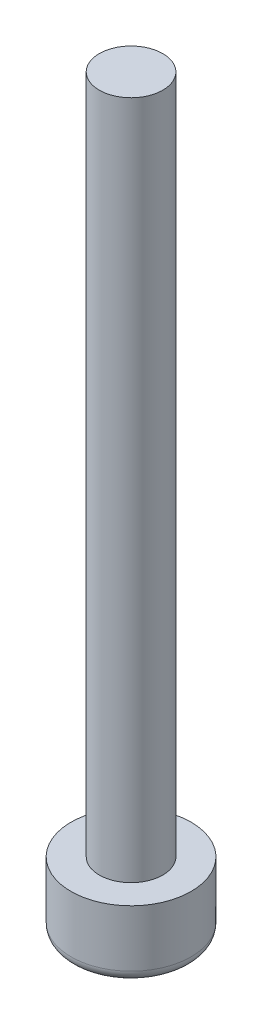
ISO-10303-21;
HEADER;
FILE_DESCRIPTION(('STEP AP214'),'2;1');
FILE_NAME('part.step','',(''),(''),'','','');
FILE_SCHEMA(('AUTOMOTIVE_DESIGN { 1 0 10303 214 1 1 1 1 }'));
ENDSEC;
DATA;
#1=APPLICATION_CONTEXT('core data for automotive mechanical design processes');
#2=APPLICATION_PROTOCOL_DEFINITION('international standard','automotive_design',2000,#1);
#3=PRODUCT_CONTEXT('',#1,'mechanical');
#4=PRODUCT('Part','Part','',(#3));
#5=PRODUCT_RELATED_PRODUCT_CATEGORY('part','',(#4));
#6=PRODUCT_DEFINITION_FORMATION('','',#4);
#7=PRODUCT_DEFINITION_CONTEXT('part definition',#1,'design');
#8=PRODUCT_DEFINITION('design','',#6,#7);
#9=PRODUCT_DEFINITION_SHAPE('','',#8);
#10=(LENGTH_UNIT() NAMED_UNIT(*) SI_UNIT(.MILLI.,.METRE.));
#11=(NAMED_UNIT(*) PLANE_ANGLE_UNIT() SI_UNIT($,.RADIAN.));
#12=(NAMED_UNIT(*) SI_UNIT($,.STERADIAN.) SOLID_ANGLE_UNIT());
#13=UNCERTAINTY_MEASURE_WITH_UNIT(LENGTH_MEASURE(1.E-05),#10,'distance_accuracy_value','');
#14=(GEOMETRIC_REPRESENTATION_CONTEXT(3) GLOBAL_UNCERTAINTY_ASSIGNED_CONTEXT((#13)) GLOBAL_UNIT_ASSIGNED_CONTEXT((#10,
#11,#12)) REPRESENTATION_CONTEXT('',''));
#15=CARTESIAN_POINT('',(0.,0.,0.));
#16=DIRECTION('',(0.,0.,1.));
#17=DIRECTION('',(1.,0.,0.));
#18=AXIS2_PLACEMENT_3D('',#15,#16,#17);
#19=CARTESIAN_POINT('',(0.,0.,0.));
#20=DIRECTION('',(0.,-1.,0.));
#21=DIRECTION('',(0.,0.,-1.));
#22=AXIS2_PLACEMENT_3D('',#19,#20,#21);
#23=PLANE('',#22);
#24=CARTESIAN_POINT('',(0.,0.,0.));
#25=DIRECTION('',(0.,-1.,0.));
#26=DIRECTION('',(0.,0.,-1.));
#27=AXIS2_PLACEMENT_3D('',#24,#25,#26);
#28=CIRCLE('',#27,2.15);
#29=CARTESIAN_POINT('',(0.,0.,-2.15));
#30=VERTEX_POINT('',#29);
#31=EDGE_CURVE('E49',#30,#30,#28,.T.);
#32=ORIENTED_EDGE('',*,*,#31,.T.);
#33=EDGE_LOOP('',(#32));
#34=FACE_BOUND('',#33,.T.);
#35=CARTESIAN_POINT('',(0.,0.,0.));
#36=DIRECTION('',(0.,-1.,0.));
#37=DIRECTION('',(0.,0.,-1.));
#38=AXIS2_PLACEMENT_3D('',#35,#36,#37);
#39=CIRCLE('',#38,1.75);
#40=CARTESIAN_POINT('',(0.,0.,-1.75));
#41=VERTEX_POINT('',#40);
#42=EDGE_CURVE('E189',#41,#41,#39,.T.);
#43=ORIENTED_EDGE('',*,*,#42,.F.);
#44=EDGE_LOOP('',(#43));
#45=FACE_BOUND('',#44,.T.);
#46=ADVANCED_FACE('F41',(#34,#45),#23,.T.);
#47=CARTESIAN_POINT('',(0.,0.,0.));
#48=DIRECTION('',(0.,-1.,0.));
#49=DIRECTION('',(0.,0.,-1.));
#50=AXIS2_PLACEMENT_3D('',#47,#48,#49);
#51=CYLINDRICAL_SURFACE('',#50,2.65);
#52=CARTESIAN_POINT('',(0.,0.5,0.));
#53=DIRECTION('',(0.,-1.,0.));
#54=DIRECTION('',(0.,0.,-1.));
#55=AXIS2_PLACEMENT_3D('',#52,#53,#54);
#56=CIRCLE('',#55,2.65);
#57=CARTESIAN_POINT('',(0.,0.5,-2.65));
#58=VERTEX_POINT('',#57);
#59=EDGE_CURVE('E11',#58,#58,#56,.F.);
#60=ORIENTED_EDGE('',*,*,#59,.T.);
#61=EDGE_LOOP('',(#60));
#62=FACE_BOUND('',#61,.T.);
#63=CARTESIAN_POINT('',(0.,3.,0.));
#64=DIRECTION('',(0.,-1.,0.));
#65=DIRECTION('',(0.,0.,-1.));
#66=AXIS2_PLACEMENT_3D('',#63,#64,#65);
#67=CIRCLE('',#66,2.65);
#68=CARTESIAN_POINT('',(0.,3.,-2.65));
#69=VERTEX_POINT('',#68);
#70=EDGE_CURVE('E100',#69,#69,#67,.T.);
#71=ORIENTED_EDGE('',*,*,#70,.T.);
#72=EDGE_LOOP('',(#71));
#73=FACE_BOUND('',#72,.T.);
#74=ADVANCED_FACE('F145',(#62,#73),#51,.T.);
#75=CARTESIAN_POINT('',(2.65,3.,0.));
#76=DIRECTION('',(0.,1.,0.));
#77=DIRECTION('',(0.,0.,1.));
#78=AXIS2_PLACEMENT_3D('',#75,#76,#77);
#79=PLANE('',#78);
#80=CARTESIAN_POINT('',(0.,3.,0.));
#81=DIRECTION('',(0.,-1.,0.));
#82=DIRECTION('',(0.,0.,-1.));
#83=AXIS2_PLACEMENT_3D('',#80,#81,#82);
#84=CIRCLE('',#83,1.4);
#85=CARTESIAN_POINT('',(0.,3.,-1.4));
#86=VERTEX_POINT('',#85);
#87=EDGE_CURVE('E126',#86,#86,#84,.T.);
#88=ORIENTED_EDGE('',*,*,#87,.T.);
#89=EDGE_LOOP('',(#88));
#90=FACE_BOUND('',#89,.T.);
#91=ORIENTED_EDGE('',*,*,#70,.F.);
#92=EDGE_LOOP('',(#91));
#93=FACE_BOUND('',#92,.T.);
#94=ADVANCED_FACE('F148',(#90,#93),#79,.T.);
#95=CARTESIAN_POINT('',(0.,0.,0.));
#96=DIRECTION('',(0.,-1.,0.));
#97=DIRECTION('',(0.,0.,-1.));
#98=AXIS2_PLACEMENT_3D('',#95,#96,#97);
#99=CYLINDRICAL_SURFACE('',#98,1.4);
#100=CARTESIAN_POINT('',(0.,33.,0.));
#101=DIRECTION('',(0.,-1.,0.));
#102=DIRECTION('',(0.,0.,-1.));
#103=AXIS2_PLACEMENT_3D('',#100,#101,#102);
#104=CIRCLE('',#103,1.4);
#105=CARTESIAN_POINT('',(0.,33.,-1.4));
#106=VERTEX_POINT('',#105);
#107=EDGE_CURVE('E123',#106,#106,#104,.T.);
#108=ORIENTED_EDGE('',*,*,#107,.T.);
#109=EDGE_LOOP('',(#108));
#110=FACE_BOUND('',#109,.T.);
#111=ORIENTED_EDGE('',*,*,#87,.F.);
#112=EDGE_LOOP('',(#111));
#113=FACE_BOUND('',#112,.T.);
#114=ADVANCED_FACE('F154',(#110,#113),#99,.T.);
#115=CARTESIAN_POINT('',(1.4,33.,0.));
#116=DIRECTION('',(0.,1.,0.));
#117=DIRECTION('',(0.,0.,1.));
#118=AXIS2_PLACEMENT_3D('',#115,#116,#117);
#119=PLANE('',#118);
#120=ORIENTED_EDGE('',*,*,#107,.F.);
#121=EDGE_LOOP('',(#120));
#122=FACE_BOUND('',#121,.T.);
#123=ADVANCED_FACE('F158',(#122),#119,.T.);
#124=CARTESIAN_POINT('',(0.,-4.95416666666666,0.));
#125=DIRECTION('',(0.,-1.,0.));
#126=DIRECTION('',(1.,0.,0.));
#127=AXIS2_PLACEMENT_3D('',#124,#125,#126);
#128=SPHERICAL_SURFACE('',#127,5.25416666666666);
#129=ORIENTED_EDGE('',*,*,#42,.T.);
#130=EDGE_LOOP('',(#129));
#131=FACE_BOUND('',#130,.T.);
#132=CARTESIAN_POINT('',(-1.08253175473055,-4.95416666666666,0.625));
#133=DIRECTION('',(-0.866025403784438,0.,0.5));
#134=DIRECTION('',(0.5,0.,0.866025403784438));
#135=AXIS2_PLACEMENT_3D('',#132,#133,#134);
#136=CIRCLE('',#135,5.10330945182742);
#137=CARTESIAN_POINT('',(-1.44337567297406,0.0978560992932979,0.));
#138=VERTEX_POINT('',#137);
#139=CARTESIAN_POINT('',(-0.721687836487031,0.0978560992932979,1.25));
#140=VERTEX_POINT('',#139);
#141=EDGE_CURVE('E96',#138,#140,#136,.F.);
#142=ORIENTED_EDGE('',*,*,#141,.T.);
#143=CARTESIAN_POINT('',(0.,-4.95416666666666,1.25));
#144=DIRECTION('',(0.,0.,1.));
#145=DIRECTION('',(1.,0.,0.));
#146=AXIS2_PLACEMENT_3D('',#143,#144,#145);
#147=CIRCLE('',#146,5.10330945182742);
#148=CARTESIAN_POINT('',(0.721687836487032,0.0978560992932979,1.25));
#149=VERTEX_POINT('',#148);
#150=EDGE_CURVE('E107',#140,#149,#147,.F.);
#151=ORIENTED_EDGE('',*,*,#150,.T.);
#152=CARTESIAN_POINT('',(1.08253175473055,-4.95416666666666,0.624999999999999));
#153=DIRECTION('',(0.866025403784439,0.,0.5));
#154=DIRECTION('',(0.5,0.,-0.866025403784439));
#155=AXIS2_PLACEMENT_3D('',#152,#153,#154);
#156=CIRCLE('',#155,5.10330945182742);
#157=CARTESIAN_POINT('',(1.44337567297406,0.0978560992932979,0.));
#158=VERTEX_POINT('',#157);
#159=EDGE_CURVE('E195',#149,#158,#156,.F.);
#160=ORIENTED_EDGE('',*,*,#159,.T.);
#161=CARTESIAN_POINT('',(1.08253175473055,-4.95416666666666,-0.625));
#162=DIRECTION('',(0.866025403784439,0.,-0.5));
#163=DIRECTION('',(-0.5,0.,-0.866025403784439));
#164=AXIS2_PLACEMENT_3D('',#161,#162,#163);
#165=CIRCLE('',#164,5.10330945182742);
#166=CARTESIAN_POINT('',(0.721687836487031,0.0978560992932979,-1.25));
#167=VERTEX_POINT('',#166);
#168=EDGE_CURVE('E191',#158,#167,#165,.F.);
#169=ORIENTED_EDGE('',*,*,#168,.T.);
#170=CARTESIAN_POINT('',(0.,-4.95416666666666,-1.25));
#171=DIRECTION('',(0.,0.,-1.));
#172=DIRECTION('',(-1.,0.,0.));
#173=AXIS2_PLACEMENT_3D('',#170,#171,#172);
#174=CIRCLE('',#173,5.10330945182742);
#175=CARTESIAN_POINT('',(-0.721687836487034,0.0978560992932979,-1.25));
#176=VERTEX_POINT('',#175);
#177=EDGE_CURVE('E56',#167,#176,#174,.F.);
#178=ORIENTED_EDGE('',*,*,#177,.T.);
#179=CARTESIAN_POINT('',(-1.08253175473055,-4.95416666666666,-0.625));
#180=DIRECTION('',(-0.866025403784439,0.,-0.5));
#181=DIRECTION('',(-0.499999999999999,0.,0.866025403784439));
#182=AXIS2_PLACEMENT_3D('',#179,#180,#181);
#183=CIRCLE('',#182,5.10330945182742);
#184=EDGE_CURVE('E93',#176,#138,#183,.F.);
#185=ORIENTED_EDGE('',*,*,#184,.T.);
#186=EDGE_LOOP('',(#142,#151,#160,#169,#178,#185));
#187=FACE_BOUND('',#186,.T.);
#188=ADVANCED_FACE('F95',(#131,#187),#128,.F.);
#189=CARTESIAN_POINT('',(0.,2.,0.));
#190=DIRECTION('',(0.,-1.,0.));
#191=DIRECTION('',(0.,0.,-1.));
#192=AXIS2_PLACEMENT_3D('',#189,#190,#191);
#193=PLANE('',#192);
#194=DIRECTION('',(-0.5,0.,-0.866025403784438));
#195=VECTOR('',#194,1.);
#196=CARTESIAN_POINT('',(-0.721687836487031,2.,1.25));
#197=LINE('',#196,#195);
#198=CARTESIAN_POINT('',(-0.721687836487031,2.,1.25));
#199=VERTEX_POINT('',#198);
#200=CARTESIAN_POINT('',(-1.44337567297406,2.,0.));
#201=VERTEX_POINT('',#200);
#202=EDGE_CURVE('E106',#199,#201,#197,.T.);
#203=ORIENTED_EDGE('',*,*,#202,.T.);
#204=DIRECTION('',(0.499999999999999,0.,-0.866025403784439));
#205=VECTOR('',#204,1.);
#206=CARTESIAN_POINT('',(-1.44337567297406,2.,0.));
#207=LINE('',#206,#205);
#208=CARTESIAN_POINT('',(-0.721687836487033,2.,-1.25));
#209=VERTEX_POINT('',#208);
#210=EDGE_CURVE('E111',#201,#209,#207,.T.);
#211=ORIENTED_EDGE('',*,*,#210,.T.);
#212=DIRECTION('',(1.,0.,0.));
#213=VECTOR('',#212,1.);
#214=CARTESIAN_POINT('',(-0.721687836487033,2.,-1.25));
#215=LINE('',#214,#213);
#216=CARTESIAN_POINT('',(0.721687836487031,2.,-1.25));
#217=VERTEX_POINT('',#216);
#218=EDGE_CURVE('E200',#209,#217,#215,.T.);
#219=ORIENTED_EDGE('',*,*,#218,.T.);
#220=DIRECTION('',(0.5,0.,0.866025403784439));
#221=VECTOR('',#220,1.);
#222=CARTESIAN_POINT('',(0.721687836487031,2.,-1.25));
#223=LINE('',#222,#221);
#224=CARTESIAN_POINT('',(1.44337567297406,2.,0.));
#225=VERTEX_POINT('',#224);
#226=EDGE_CURVE('E203',#217,#225,#223,.T.);
#227=ORIENTED_EDGE('',*,*,#226,.T.);
#228=DIRECTION('',(-0.5,0.,0.866025403784439));
#229=VECTOR('',#228,1.);
#230=CARTESIAN_POINT('',(1.44337567297406,2.,0.));
#231=LINE('',#230,#229);
#232=CARTESIAN_POINT('',(0.721687836487032,2.,1.25));
#233=VERTEX_POINT('',#232);
#234=EDGE_CURVE('E119',#225,#233,#231,.T.);
#235=ORIENTED_EDGE('',*,*,#234,.T.);
#236=DIRECTION('',(-1.,0.,0.));
#237=VECTOR('',#236,1.);
#238=CARTESIAN_POINT('',(0.721687836487032,2.,1.25));
#239=LINE('',#238,#237);
#240=EDGE_CURVE('E114',#233,#199,#239,.T.);
#241=ORIENTED_EDGE('',*,*,#240,.T.);
#242=EDGE_LOOP('',(#203,#211,#219,#227,#235,#241));
#243=FACE_BOUND('',#242,.T.);
#244=ADVANCED_FACE('F166',(#243),#193,.T.);
#245=CARTESIAN_POINT('',(-1.44337567297406,2.,0.));
#246=DIRECTION('',(-0.866025403784439,0.,-0.5));
#247=DIRECTION('',(-0.499999999999999,0.,0.866025403784439));
#248=AXIS2_PLACEMENT_3D('',#245,#246,#247);
#249=PLANE('',#248);
#250=ORIENTED_EDGE('',*,*,#184,.F.);
#251=DIRECTION('',(0.,-1.,0.));
#252=VECTOR('',#251,1.);
#253=CARTESIAN_POINT('',(-0.721687836487033,2.,-1.25));
#254=LINE('',#253,#252);
#255=EDGE_CURVE('E113',#209,#176,#254,.T.);
#256=ORIENTED_EDGE('',*,*,#255,.F.);
#257=ORIENTED_EDGE('',*,*,#210,.F.);
#258=DIRECTION('',(0.,-1.,0.));
#259=VECTOR('',#258,1.);
#260=CARTESIAN_POINT('',(-1.44337567297406,2.,0.));
#261=LINE('',#260,#259);
#262=EDGE_CURVE('E104',#201,#138,#261,.T.);
#263=ORIENTED_EDGE('',*,*,#262,.T.);
#264=EDGE_LOOP('',(#250,#256,#257,#263));
#265=FACE_BOUND('',#264,.T.);
#266=ADVANCED_FACE('F109',(#265),#249,.F.);
#267=CARTESIAN_POINT('',(-0.721687836487033,2.,-1.25));
#268=DIRECTION('',(0.,0.,-1.));
#269=DIRECTION('',(-1.,0.,0.));
#270=AXIS2_PLACEMENT_3D('',#267,#268,#269);
#271=PLANE('',#270);
#272=ORIENTED_EDGE('',*,*,#177,.F.);
#273=DIRECTION('',(0.,-1.,0.));
#274=VECTOR('',#273,1.);
#275=CARTESIAN_POINT('',(0.721687836487031,2.,-1.25));
#276=LINE('',#275,#274);
#277=EDGE_CURVE('E116',#217,#167,#276,.T.);
#278=ORIENTED_EDGE('',*,*,#277,.F.);
#279=ORIENTED_EDGE('',*,*,#218,.F.);
#280=ORIENTED_EDGE('',*,*,#255,.T.);
#281=EDGE_LOOP('',(#272,#278,#279,#280));
#282=FACE_BOUND('',#281,.T.);
#283=ADVANCED_FACE('F165',(#282),#271,.F.);
#284=CARTESIAN_POINT('',(0.721687836487031,2.,-1.25));
#285=DIRECTION('',(0.866025403784439,0.,-0.5));
#286=DIRECTION('',(-0.5,0.,-0.866025403784439));
#287=AXIS2_PLACEMENT_3D('',#284,#285,#286);
#288=PLANE('',#287);
#289=ORIENTED_EDGE('',*,*,#168,.F.);
#290=DIRECTION('',(0.,-1.,0.));
#291=VECTOR('',#290,1.);
#292=CARTESIAN_POINT('',(1.44337567297406,2.,0.));
#293=LINE('',#292,#291);
#294=EDGE_CURVE('E212',#225,#158,#293,.T.);
#295=ORIENTED_EDGE('',*,*,#294,.F.);
#296=ORIENTED_EDGE('',*,*,#226,.F.);
#297=ORIENTED_EDGE('',*,*,#277,.T.);
#298=EDGE_LOOP('',(#289,#295,#296,#297));
#299=FACE_BOUND('',#298,.T.);
#300=ADVANCED_FACE('F169',(#299),#288,.F.);
#301=CARTESIAN_POINT('',(1.44337567297406,2.,0.));
#302=DIRECTION('',(0.866025403784439,0.,0.5));
#303=DIRECTION('',(0.5,0.,-0.866025403784439));
#304=AXIS2_PLACEMENT_3D('',#301,#302,#303);
#305=PLANE('',#304);
#306=ORIENTED_EDGE('',*,*,#159,.F.);
#307=DIRECTION('',(0.,-1.,0.));
#308=VECTOR('',#307,1.);
#309=CARTESIAN_POINT('',(0.721687836487032,2.,1.25));
#310=LINE('',#309,#308);
#311=EDGE_CURVE('E209',#233,#149,#310,.T.);
#312=ORIENTED_EDGE('',*,*,#311,.F.);
#313=ORIENTED_EDGE('',*,*,#234,.F.);
#314=ORIENTED_EDGE('',*,*,#294,.T.);
#315=EDGE_LOOP('',(#306,#312,#313,#314));
#316=FACE_BOUND('',#315,.T.);
#317=ADVANCED_FACE('F173',(#316),#305,.F.);
#318=CARTESIAN_POINT('',(0.721687836487032,2.,1.25));
#319=DIRECTION('',(0.,0.,1.));
#320=DIRECTION('',(1.,0.,0.));
#321=AXIS2_PLACEMENT_3D('',#318,#319,#320);
#322=PLANE('',#321);
#323=ORIENTED_EDGE('',*,*,#150,.F.);
#324=DIRECTION('',(0.,-1.,0.));
#325=VECTOR('',#324,1.);
#326=CARTESIAN_POINT('',(-0.721687836487031,2.,1.25));
#327=LINE('',#326,#325);
#328=EDGE_CURVE('E64',#199,#140,#327,.T.);
#329=ORIENTED_EDGE('',*,*,#328,.F.);
#330=ORIENTED_EDGE('',*,*,#240,.F.);
#331=ORIENTED_EDGE('',*,*,#311,.T.);
#332=EDGE_LOOP('',(#323,#329,#330,#331));
#333=FACE_BOUND('',#332,.T.);
#334=ADVANCED_FACE('F141',(#333),#322,.F.);
#335=CARTESIAN_POINT('',(-0.721687836487031,2.,1.25));
#336=DIRECTION('',(-0.866025403784438,0.,0.5));
#337=DIRECTION('',(0.5,0.,0.866025403784438));
#338=AXIS2_PLACEMENT_3D('',#335,#336,#337);
#339=PLANE('',#338);
#340=ORIENTED_EDGE('',*,*,#141,.F.);
#341=ORIENTED_EDGE('',*,*,#262,.F.);
#342=ORIENTED_EDGE('',*,*,#202,.F.);
#343=ORIENTED_EDGE('',*,*,#328,.T.);
#344=EDGE_LOOP('',(#340,#341,#342,#343));
#345=FACE_BOUND('',#344,.T.);
#346=ADVANCED_FACE('F103',(#345),#339,.F.);
#347=CARTESIAN_POINT('',(0.,0.5,0.));
#348=DIRECTION('',(0.,-1.,0.));
#349=DIRECTION('',(0.,0.,-1.));
#350=AXIS2_PLACEMENT_3D('',#347,#348,#349);
#351=TOROIDAL_SURFACE('',#350,2.15,0.5);
#352=ORIENTED_EDGE('',*,*,#59,.F.);
#353=EDGE_LOOP('',(#352));
#354=FACE_BOUND('',#353,.T.);
#355=ORIENTED_EDGE('',*,*,#31,.F.);
#356=EDGE_LOOP('',(#355));
#357=FACE_BOUND('',#356,.T.);
#358=ADVANCED_FACE('F43',(#354,#357),#351,.T.);
#359=CLOSED_SHELL('',(#46,#74,#94,#114,#123,#188,#244,#266,#283,#300,#317,#334,#346,#358));
#360=MANIFOLD_SOLID_BREP('B2',#359);
#361=ADVANCED_BREP_SHAPE_REPRESENTATION('',(#18,#360),#14);
#362=SHAPE_DEFINITION_REPRESENTATION(#9,#361);
ENDSEC;
END-ISO-10303-21;
